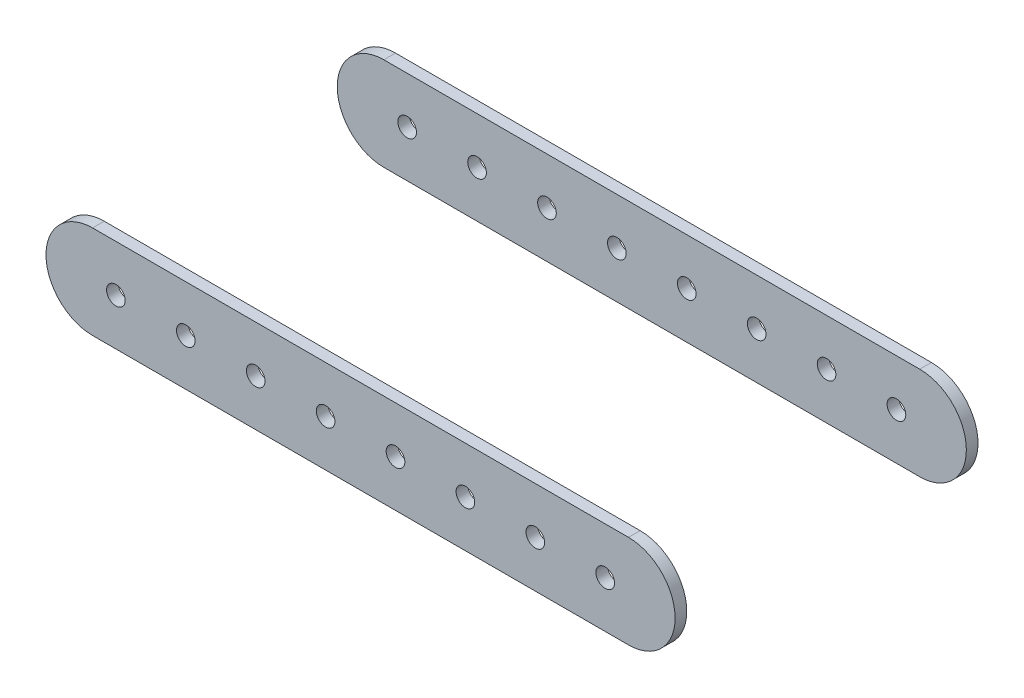
ISO-10303-21;
HEADER;
FILE_DESCRIPTION(('STEP AP214'),'2;1');
FILE_NAME('part.step','',(''),(''),'','','');
FILE_SCHEMA(('AUTOMOTIVE_DESIGN { 1 0 10303 214 1 1 1 1 }'));
ENDSEC;
DATA;
#1=APPLICATION_CONTEXT('core data for automotive mechanical design processes');
#2=APPLICATION_PROTOCOL_DEFINITION('international standard','automotive_design',2000,#1);
#3=PRODUCT_CONTEXT('',#1,'mechanical');
#4=PRODUCT('Part','Part','',(#3));
#5=PRODUCT_RELATED_PRODUCT_CATEGORY('part','',(#4));
#6=PRODUCT_DEFINITION_FORMATION('','',#4);
#7=PRODUCT_DEFINITION_CONTEXT('part definition',#1,'design');
#8=PRODUCT_DEFINITION('design','',#6,#7);
#9=PRODUCT_DEFINITION_SHAPE('','',#8);
#10=(LENGTH_UNIT() NAMED_UNIT(*) SI_UNIT(.MILLI.,.METRE.));
#11=(NAMED_UNIT(*) PLANE_ANGLE_UNIT() SI_UNIT($,.RADIAN.));
#12=(NAMED_UNIT(*) SI_UNIT($,.STERADIAN.) SOLID_ANGLE_UNIT());
#13=UNCERTAINTY_MEASURE_WITH_UNIT(LENGTH_MEASURE(1.E-05),#10,'distance_accuracy_value','');
#14=(GEOMETRIC_REPRESENTATION_CONTEXT(3) GLOBAL_UNCERTAINTY_ASSIGNED_CONTEXT((#13)) GLOBAL_UNIT_ASSIGNED_CONTEXT((#10,
#11,#12)) REPRESENTATION_CONTEXT('',''));
#15=CARTESIAN_POINT('',(0.,0.,0.));
#16=DIRECTION('',(0.,0.,1.));
#17=DIRECTION('',(1.,0.,0.));
#18=AXIS2_PLACEMENT_3D('',#15,#16,#17);
#19=CARTESIAN_POINT('',(-10.,0.,-65.));
#20=DIRECTION('',(0.,0.,-1.));
#21=DIRECTION('',(1.,0.,0.));
#22=AXIS2_PLACEMENT_3D('',#19,#20,#21);
#23=PLANE('',#22);
#24=CARTESIAN_POINT('',(150.,0.,-65.));
#25=DIRECTION('',(0.,0.,1.));
#26=DIRECTION('',(1.,0.,0.));
#27=AXIS2_PLACEMENT_3D('',#24,#25,#26);
#28=CIRCLE('',#27,3.99999999999999);
#29=CARTESIAN_POINT('',(154.,0.,-65.));
#30=VERTEX_POINT('',#29);
#31=EDGE_CURVE('E210',#30,#30,#28,.T.);
#32=ORIENTED_EDGE('',*,*,#31,.T.);
#33=EDGE_LOOP('',(#32));
#34=FACE_BOUND('',#33,.T.);
#35=CARTESIAN_POINT('',(90.,0.,-65.));
#36=DIRECTION('',(0.,0.,1.));
#37=DIRECTION('',(1.,0.,0.));
#38=AXIS2_PLACEMENT_3D('',#35,#36,#37);
#39=CIRCLE('',#38,4.00000000000001);
#40=CARTESIAN_POINT('',(94.,0.,-65.));
#41=VERTEX_POINT('',#40);
#42=EDGE_CURVE('E217',#41,#41,#39,.T.);
#43=ORIENTED_EDGE('',*,*,#42,.T.);
#44=EDGE_LOOP('',(#43));
#45=FACE_BOUND('',#44,.T.);
#46=CARTESIAN_POINT('',(30.,0.,-65.));
#47=DIRECTION('',(0.,0.,1.));
#48=DIRECTION('',(1.,0.,0.));
#49=AXIS2_PLACEMENT_3D('',#46,#47,#48);
#50=CIRCLE('',#49,4.);
#51=CARTESIAN_POINT('',(34.,0.,-65.));
#52=VERTEX_POINT('',#51);
#53=EDGE_CURVE('E222',#52,#52,#50,.T.);
#54=ORIENTED_EDGE('',*,*,#53,.T.);
#55=EDGE_LOOP('',(#54));
#56=FACE_BOUND('',#55,.T.);
#57=CARTESIAN_POINT('',(0.,0.,-65.));
#58=DIRECTION('',(0.,0.,1.));
#59=DIRECTION('',(1.,0.,0.));
#60=AXIS2_PLACEMENT_3D('',#57,#58,#59);
#61=CIRCLE('',#60,4.);
#62=CARTESIAN_POINT('',(4.,0.,-65.));
#63=VERTEX_POINT('',#62);
#64=EDGE_CURVE('E114',#63,#63,#61,.T.);
#65=ORIENTED_EDGE('',*,*,#64,.T.);
#66=EDGE_LOOP('',(#65));
#67=FACE_BOUND('',#66,.T.);
#68=CARTESIAN_POINT('',(-10.,0.,-65.));
#69=DIRECTION('',(0.,0.,1.));
#70=DIRECTION('',(1.,0.,0.));
#71=AXIS2_PLACEMENT_3D('',#68,#69,#70);
#72=CIRCLE('',#71,20.);
#73=CARTESIAN_POINT('',(-10.,20.,-65.));
#74=VERTEX_POINT('',#73);
#75=CARTESIAN_POINT('',(-10.,-20.,-65.));
#76=VERTEX_POINT('',#75);
#77=EDGE_CURVE('E102',#74,#76,#72,.T.);
#78=ORIENTED_EDGE('',*,*,#77,.F.);
#79=DIRECTION('',(-1.,0.,0.));
#80=VECTOR('',#79,1.);
#81=CARTESIAN_POINT('',(-10.,20.,-65.));
#82=LINE('',#81,#80);
#83=CARTESIAN_POINT('',(220.,20.,-65.));
#84=VERTEX_POINT('',#83);
#85=EDGE_CURVE('E105',#84,#74,#82,.T.);
#86=ORIENTED_EDGE('',*,*,#85,.F.);
#87=CARTESIAN_POINT('',(220.,0.,-65.));
#88=DIRECTION('',(0.,0.,1.));
#89=DIRECTION('',(1.,0.,0.));
#90=AXIS2_PLACEMENT_3D('',#87,#88,#89);
#91=CIRCLE('',#90,20.);
#92=CARTESIAN_POINT('',(220.,-20.,-65.));
#93=VERTEX_POINT('',#92);
#94=EDGE_CURVE('E92',#93,#84,#91,.T.);
#95=ORIENTED_EDGE('',*,*,#94,.F.);
#96=DIRECTION('',(1.,0.,0.));
#97=VECTOR('',#96,1.);
#98=CARTESIAN_POINT('',(-10.,-20.,-65.));
#99=LINE('',#98,#97);
#100=EDGE_CURVE('E98',#76,#93,#99,.T.);
#101=ORIENTED_EDGE('',*,*,#100,.F.);
#102=EDGE_LOOP('',(#78,#86,#95,#101));
#103=FACE_BOUND('',#102,.T.);
#104=CARTESIAN_POINT('',(210.,0.,-65.));
#105=DIRECTION('',(0.,0.,1.));
#106=DIRECTION('',(1.,0.,0.));
#107=AXIS2_PLACEMENT_3D('',#104,#105,#106);
#108=CIRCLE('',#107,3.99999999999999);
#109=CARTESIAN_POINT('',(214.,0.,-65.));
#110=VERTEX_POINT('',#109);
#111=EDGE_CURVE('E142',#110,#110,#108,.T.);
#112=ORIENTED_EDGE('',*,*,#111,.T.);
#113=EDGE_LOOP('',(#112));
#114=FACE_BOUND('',#113,.T.);
#115=CARTESIAN_POINT('',(60.,0.,-65.));
#116=DIRECTION('',(0.,0.,1.));
#117=DIRECTION('',(1.,0.,0.));
#118=AXIS2_PLACEMENT_3D('',#115,#116,#117);
#119=CIRCLE('',#118,4.00000000000001);
#120=CARTESIAN_POINT('',(64.,0.,-65.));
#121=VERTEX_POINT('',#120);
#122=EDGE_CURVE('E220',#121,#121,#119,.T.);
#123=ORIENTED_EDGE('',*,*,#122,.T.);
#124=EDGE_LOOP('',(#123));
#125=FACE_BOUND('',#124,.T.);
#126=CARTESIAN_POINT('',(120.,0.,-65.));
#127=DIRECTION('',(0.,0.,1.));
#128=DIRECTION('',(1.,0.,0.));
#129=AXIS2_PLACEMENT_3D('',#126,#127,#128);
#130=CIRCLE('',#129,4.00000000000001);
#131=CARTESIAN_POINT('',(124.,0.,-65.));
#132=VERTEX_POINT('',#131);
#133=EDGE_CURVE('E212',#132,#132,#130,.T.);
#134=ORIENTED_EDGE('',*,*,#133,.T.);
#135=EDGE_LOOP('',(#134));
#136=FACE_BOUND('',#135,.T.);
#137=CARTESIAN_POINT('',(180.,0.,-65.));
#138=DIRECTION('',(0.,0.,1.));
#139=DIRECTION('',(1.,0.,0.));
#140=AXIS2_PLACEMENT_3D('',#137,#138,#139);
#141=CIRCLE('',#140,3.99999999999999);
#142=CARTESIAN_POINT('',(184.,0.,-65.));
#143=VERTEX_POINT('',#142);
#144=EDGE_CURVE('E125',#143,#143,#141,.T.);
#145=ORIENTED_EDGE('',*,*,#144,.T.);
#146=EDGE_LOOP('',(#145));
#147=FACE_BOUND('',#146,.T.);
#148=ADVANCED_FACE('F43',(#34,#45,#56,#67,#103,#114,#125,#136,#147),#23,.T.);
#149=CARTESIAN_POINT('',(-10.,0.,-60.));
#150=DIRECTION('',(0.,0.,-1.));
#151=DIRECTION('',(1.,0.,0.));
#152=AXIS2_PLACEMENT_3D('',#149,#150,#151);
#153=PLANE('',#152);
#154=CARTESIAN_POINT('',(-10.,0.,-60.));
#155=DIRECTION('',(0.,0.,1.));
#156=DIRECTION('',(1.,0.,0.));
#157=AXIS2_PLACEMENT_3D('',#154,#155,#156);
#158=CIRCLE('',#157,20.);
#159=CARTESIAN_POINT('',(-10.,20.,-60.));
#160=VERTEX_POINT('',#159);
#161=CARTESIAN_POINT('',(-10.,-20.,-60.));
#162=VERTEX_POINT('',#161);
#163=EDGE_CURVE('E110',#160,#162,#158,.T.);
#164=ORIENTED_EDGE('',*,*,#163,.T.);
#165=DIRECTION('',(1.,0.,0.));
#166=VECTOR('',#165,1.);
#167=CARTESIAN_POINT('',(-10.,-20.,-60.));
#168=LINE('',#167,#166);
#169=CARTESIAN_POINT('',(220.,-20.,-60.));
#170=VERTEX_POINT('',#169);
#171=EDGE_CURVE('E113',#162,#170,#168,.T.);
#172=ORIENTED_EDGE('',*,*,#171,.T.);
#173=CARTESIAN_POINT('',(220.,0.,-60.));
#174=DIRECTION('',(0.,0.,1.));
#175=DIRECTION('',(1.,0.,0.));
#176=AXIS2_PLACEMENT_3D('',#173,#174,#175);
#177=CIRCLE('',#176,20.);
#178=CARTESIAN_POINT('',(220.,20.,-60.));
#179=VERTEX_POINT('',#178);
#180=EDGE_CURVE('E95',#170,#179,#177,.T.);
#181=ORIENTED_EDGE('',*,*,#180,.T.);
#182=DIRECTION('',(-1.,0.,0.));
#183=VECTOR('',#182,1.);
#184=CARTESIAN_POINT('',(-10.,20.,-60.));
#185=LINE('',#184,#183);
#186=EDGE_CURVE('E117',#179,#160,#185,.T.);
#187=ORIENTED_EDGE('',*,*,#186,.T.);
#188=EDGE_LOOP('',(#164,#172,#181,#187));
#189=FACE_BOUND('',#188,.T.);
#190=CARTESIAN_POINT('',(0.,0.,-60.));
#191=DIRECTION('',(0.,0.,1.));
#192=DIRECTION('',(1.,0.,0.));
#193=AXIS2_PLACEMENT_3D('',#190,#191,#192);
#194=CIRCLE('',#193,4.);
#195=CARTESIAN_POINT('',(4.,0.,-60.));
#196=VERTEX_POINT('',#195);
#197=EDGE_CURVE('E147',#196,#196,#194,.T.);
#198=ORIENTED_EDGE('',*,*,#197,.F.);
#199=EDGE_LOOP('',(#198));
#200=FACE_BOUND('',#199,.T.);
#201=CARTESIAN_POINT('',(210.,0.,-60.));
#202=DIRECTION('',(0.,0.,1.));
#203=DIRECTION('',(1.,0.,0.));
#204=AXIS2_PLACEMENT_3D('',#201,#202,#203);
#205=CIRCLE('',#204,3.99999999999999);
#206=CARTESIAN_POINT('',(214.,0.,-60.));
#207=VERTEX_POINT('',#206);
#208=EDGE_CURVE('E138',#207,#207,#205,.T.);
#209=ORIENTED_EDGE('',*,*,#208,.F.);
#210=EDGE_LOOP('',(#209));
#211=FACE_BOUND('',#210,.T.);
#212=CARTESIAN_POINT('',(30.,0.,-60.));
#213=DIRECTION('',(0.,0.,-1.));
#214=DIRECTION('',(-1.,0.,0.));
#215=AXIS2_PLACEMENT_3D('',#212,#213,#214);
#216=CIRCLE('',#215,4.);
#217=CARTESIAN_POINT('',(26.,0.,-60.));
#218=VERTEX_POINT('',#217);
#219=EDGE_CURVE('E121',#218,#218,#216,.F.);
#220=ORIENTED_EDGE('',*,*,#219,.F.);
#221=EDGE_LOOP('',(#220));
#222=FACE_BOUND('',#221,.T.);
#223=CARTESIAN_POINT('',(60.,0.,-60.));
#224=DIRECTION('',(0.,0.,-1.));
#225=DIRECTION('',(-1.,0.,0.));
#226=AXIS2_PLACEMENT_3D('',#223,#224,#225);
#227=CIRCLE('',#226,4.00000000000001);
#228=CARTESIAN_POINT('',(56.,0.,-60.));
#229=VERTEX_POINT('',#228);
#230=EDGE_CURVE('E124',#229,#229,#227,.F.);
#231=ORIENTED_EDGE('',*,*,#230,.F.);
#232=EDGE_LOOP('',(#231));
#233=FACE_BOUND('',#232,.T.);
#234=CARTESIAN_POINT('',(90.,0.,-60.));
#235=DIRECTION('',(0.,0.,-1.));
#236=DIRECTION('',(-1.,0.,0.));
#237=AXIS2_PLACEMENT_3D('',#234,#235,#236);
#238=CIRCLE('',#237,4.00000000000001);
#239=CARTESIAN_POINT('',(86.,0.,-60.));
#240=VERTEX_POINT('',#239);
#241=EDGE_CURVE('E128',#240,#240,#238,.F.);
#242=ORIENTED_EDGE('',*,*,#241,.F.);
#243=EDGE_LOOP('',(#242));
#244=FACE_BOUND('',#243,.T.);
#245=CARTESIAN_POINT('',(120.,0.,-60.));
#246=DIRECTION('',(0.,0.,-1.));
#247=DIRECTION('',(-1.,0.,0.));
#248=AXIS2_PLACEMENT_3D('',#245,#246,#247);
#249=CIRCLE('',#248,4.00000000000001);
#250=CARTESIAN_POINT('',(116.,0.,-60.));
#251=VERTEX_POINT('',#250);
#252=EDGE_CURVE('E131',#251,#251,#249,.F.);
#253=ORIENTED_EDGE('',*,*,#252,.F.);
#254=EDGE_LOOP('',(#253));
#255=FACE_BOUND('',#254,.T.);
#256=CARTESIAN_POINT('',(150.,0.,-60.));
#257=DIRECTION('',(0.,0.,-1.));
#258=DIRECTION('',(-1.,0.,0.));
#259=AXIS2_PLACEMENT_3D('',#256,#257,#258);
#260=CIRCLE('',#259,3.99999999999999);
#261=CARTESIAN_POINT('',(146.,0.,-60.));
#262=VERTEX_POINT('',#261);
#263=EDGE_CURVE('E133',#262,#262,#260,.F.);
#264=ORIENTED_EDGE('',*,*,#263,.F.);
#265=EDGE_LOOP('',(#264));
#266=FACE_BOUND('',#265,.T.);
#267=CARTESIAN_POINT('',(180.,0.,-60.));
#268=DIRECTION('',(0.,0.,-1.));
#269=DIRECTION('',(-1.,0.,0.));
#270=AXIS2_PLACEMENT_3D('',#267,#268,#269);
#271=CIRCLE('',#270,3.99999999999999);
#272=CARTESIAN_POINT('',(176.,0.,-60.));
#273=VERTEX_POINT('',#272);
#274=EDGE_CURVE('E47',#273,#273,#271,.F.);
#275=ORIENTED_EDGE('',*,*,#274,.F.);
#276=EDGE_LOOP('',(#275));
#277=FACE_BOUND('',#276,.T.);
#278=ADVANCED_FACE('F155',(#189,#200,#211,#222,#233,#244,#255,#266,#277),#153,.F.);
#279=CARTESIAN_POINT('',(-10.,0.,-65.));
#280=DIRECTION('',(0.,0.,1.));
#281=DIRECTION('',(-1.,0.,0.));
#282=AXIS2_PLACEMENT_3D('',#279,#280,#281);
#283=CYLINDRICAL_SURFACE('',#282,20.);
#284=ORIENTED_EDGE('',*,*,#163,.F.);
#285=DIRECTION('',(0.,0.,1.));
#286=VECTOR('',#285,1.);
#287=CARTESIAN_POINT('',(-10.,20.,-65.));
#288=LINE('',#287,#286);
#289=EDGE_CURVE('E62',#74,#160,#288,.T.);
#290=ORIENTED_EDGE('',*,*,#289,.F.);
#291=ORIENTED_EDGE('',*,*,#77,.T.);
#292=DIRECTION('',(0.,0.,1.));
#293=VECTOR('',#292,1.);
#294=CARTESIAN_POINT('',(-10.,-20.,-65.));
#295=LINE('',#294,#293);
#296=EDGE_CURVE('E12',#76,#162,#295,.T.);
#297=ORIENTED_EDGE('',*,*,#296,.T.);
#298=EDGE_LOOP('',(#284,#290,#291,#297));
#299=FACE_BOUND('',#298,.T.);
#300=ADVANCED_FACE('F45',(#299),#283,.T.);
#301=CARTESIAN_POINT('',(-10.,-20.,-65.));
#302=DIRECTION('',(0.,1.,0.));
#303=DIRECTION('',(0.,0.,-1.));
#304=AXIS2_PLACEMENT_3D('',#301,#302,#303);
#305=PLANE('',#304);
#306=ORIENTED_EDGE('',*,*,#171,.F.);
#307=ORIENTED_EDGE('',*,*,#296,.F.);
#308=ORIENTED_EDGE('',*,*,#100,.T.);
#309=DIRECTION('',(0.,0.,1.));
#310=VECTOR('',#309,1.);
#311=CARTESIAN_POINT('',(220.,-20.,-65.));
#312=LINE('',#311,#310);
#313=EDGE_CURVE('E53',#93,#170,#312,.T.);
#314=ORIENTED_EDGE('',*,*,#313,.T.);
#315=EDGE_LOOP('',(#306,#307,#308,#314));
#316=FACE_BOUND('',#315,.T.);
#317=ADVANCED_FACE('F99',(#316),#305,.F.);
#318=CARTESIAN_POINT('',(220.,0.,-65.));
#319=DIRECTION('',(0.,0.,1.));
#320=DIRECTION('',(-1.,0.,0.));
#321=AXIS2_PLACEMENT_3D('',#318,#319,#320);
#322=CYLINDRICAL_SURFACE('',#321,20.);
#323=ORIENTED_EDGE('',*,*,#180,.F.);
#324=ORIENTED_EDGE('',*,*,#313,.F.);
#325=ORIENTED_EDGE('',*,*,#94,.T.);
#326=DIRECTION('',(0.,0.,1.));
#327=VECTOR('',#326,1.);
#328=CARTESIAN_POINT('',(220.,20.,-65.));
#329=LINE('',#328,#327);
#330=EDGE_CURVE('E78',#84,#179,#329,.T.);
#331=ORIENTED_EDGE('',*,*,#330,.T.);
#332=EDGE_LOOP('',(#323,#324,#325,#331));
#333=FACE_BOUND('',#332,.T.);
#334=ADVANCED_FACE('F90',(#333),#322,.T.);
#335=CARTESIAN_POINT('',(-10.,20.,-65.));
#336=DIRECTION('',(0.,-1.,0.));
#337=DIRECTION('',(0.,0.,1.));
#338=AXIS2_PLACEMENT_3D('',#335,#336,#337);
#339=PLANE('',#338);
#340=ORIENTED_EDGE('',*,*,#186,.F.);
#341=ORIENTED_EDGE('',*,*,#330,.F.);
#342=ORIENTED_EDGE('',*,*,#85,.T.);
#343=ORIENTED_EDGE('',*,*,#289,.T.);
#344=EDGE_LOOP('',(#340,#341,#342,#343));
#345=FACE_BOUND('',#344,.T.);
#346=ADVANCED_FACE('F157',(#345),#339,.F.);
#347=CARTESIAN_POINT('',(0.,0.,-65.));
#348=DIRECTION('',(0.,0.,1.));
#349=DIRECTION('',(-1.,0.,0.));
#350=AXIS2_PLACEMENT_3D('',#347,#348,#349);
#351=CYLINDRICAL_SURFACE('',#350,4.);
#352=ORIENTED_EDGE('',*,*,#64,.F.);
#353=EDGE_LOOP('',(#352));
#354=FACE_BOUND('',#353,.T.);
#355=ORIENTED_EDGE('',*,*,#197,.T.);
#356=EDGE_LOOP('',(#355));
#357=FACE_BOUND('',#356,.T.);
#358=ADVANCED_FACE('F159',(#354,#357),#351,.F.);
#359=CARTESIAN_POINT('',(210.,0.,-65.));
#360=DIRECTION('',(0.,0.,1.));
#361=DIRECTION('',(-1.,0.,0.));
#362=AXIS2_PLACEMENT_3D('',#359,#360,#361);
#363=CYLINDRICAL_SURFACE('',#362,3.99999999999999);
#364=ORIENTED_EDGE('',*,*,#111,.F.);
#365=EDGE_LOOP('',(#364));
#366=FACE_BOUND('',#365,.T.);
#367=ORIENTED_EDGE('',*,*,#208,.T.);
#368=EDGE_LOOP('',(#367));
#369=FACE_BOUND('',#368,.T.);
#370=ADVANCED_FACE('F165',(#366,#369),#363,.F.);
#371=CARTESIAN_POINT('',(30.,0.,65.));
#372=DIRECTION('',(0.,0.,-1.));
#373=DIRECTION('',(-1.,0.,0.));
#374=AXIS2_PLACEMENT_3D('',#371,#372,#373);
#375=CYLINDRICAL_SURFACE('',#374,4.);
#376=ORIENTED_EDGE('',*,*,#53,.F.);
#377=EDGE_LOOP('',(#376));
#378=FACE_BOUND('',#377,.T.);
#379=ORIENTED_EDGE('',*,*,#219,.T.);
#380=EDGE_LOOP('',(#379));
#381=FACE_BOUND('',#380,.T.);
#382=ADVANCED_FACE('F181',(#378,#381),#375,.F.);
#383=CARTESIAN_POINT('',(60.,0.,65.));
#384=DIRECTION('',(0.,0.,-1.));
#385=DIRECTION('',(-1.,0.,0.));
#386=AXIS2_PLACEMENT_3D('',#383,#384,#385);
#387=CYLINDRICAL_SURFACE('',#386,4.00000000000001);
#388=ORIENTED_EDGE('',*,*,#122,.F.);
#389=EDGE_LOOP('',(#388));
#390=FACE_BOUND('',#389,.T.);
#391=ORIENTED_EDGE('',*,*,#230,.T.);
#392=EDGE_LOOP('',(#391));
#393=FACE_BOUND('',#392,.T.);
#394=ADVANCED_FACE('F185',(#390,#393),#387,.F.);
#395=CARTESIAN_POINT('',(90.,0.,65.));
#396=DIRECTION('',(0.,0.,-1.));
#397=DIRECTION('',(-1.,0.,0.));
#398=AXIS2_PLACEMENT_3D('',#395,#396,#397);
#399=CYLINDRICAL_SURFACE('',#398,4.00000000000001);
#400=ORIENTED_EDGE('',*,*,#42,.F.);
#401=EDGE_LOOP('',(#400));
#402=FACE_BOUND('',#401,.T.);
#403=ORIENTED_EDGE('',*,*,#241,.T.);
#404=EDGE_LOOP('',(#403));
#405=FACE_BOUND('',#404,.T.);
#406=ADVANCED_FACE('F189',(#402,#405),#399,.F.);
#407=CARTESIAN_POINT('',(120.,0.,65.));
#408=DIRECTION('',(0.,0.,-1.));
#409=DIRECTION('',(-1.,0.,0.));
#410=AXIS2_PLACEMENT_3D('',#407,#408,#409);
#411=CYLINDRICAL_SURFACE('',#410,4.00000000000001);
#412=ORIENTED_EDGE('',*,*,#133,.F.);
#413=EDGE_LOOP('',(#412));
#414=FACE_BOUND('',#413,.T.);
#415=ORIENTED_EDGE('',*,*,#252,.T.);
#416=EDGE_LOOP('',(#415));
#417=FACE_BOUND('',#416,.T.);
#418=ADVANCED_FACE('F193',(#414,#417),#411,.F.);
#419=CARTESIAN_POINT('',(150.,0.,65.));
#420=DIRECTION('',(0.,0.,-1.));
#421=DIRECTION('',(-1.,0.,0.));
#422=AXIS2_PLACEMENT_3D('',#419,#420,#421);
#423=CYLINDRICAL_SURFACE('',#422,3.99999999999999);
#424=ORIENTED_EDGE('',*,*,#31,.F.);
#425=EDGE_LOOP('',(#424));
#426=FACE_BOUND('',#425,.T.);
#427=ORIENTED_EDGE('',*,*,#263,.T.);
#428=EDGE_LOOP('',(#427));
#429=FACE_BOUND('',#428,.T.);
#430=ADVANCED_FACE('F197',(#426,#429),#423,.F.);
#431=CARTESIAN_POINT('',(180.,0.,65.));
#432=DIRECTION('',(0.,0.,-1.));
#433=DIRECTION('',(-1.,0.,0.));
#434=AXIS2_PLACEMENT_3D('',#431,#432,#433);
#435=CYLINDRICAL_SURFACE('',#434,3.99999999999999);
#436=ORIENTED_EDGE('',*,*,#144,.F.);
#437=EDGE_LOOP('',(#436));
#438=FACE_BOUND('',#437,.T.);
#439=ORIENTED_EDGE('',*,*,#274,.T.);
#440=EDGE_LOOP('',(#439));
#441=FACE_BOUND('',#440,.T.);
#442=ADVANCED_FACE('F201',(#438,#441),#435,.F.);
#443=CLOSED_SHELL('',(#148,#278,#300,#317,#334,#346,#358,#370,#382,#394,#406,#418,#430,#442));
#444=MANIFOLD_SOLID_BREP('B2',#443);
#445=CARTESIAN_POINT('',(-10.,0.,65.));
#446=DIRECTION('',(0.,0.,1.));
#447=DIRECTION('',(1.,0.,0.));
#448=AXIS2_PLACEMENT_3D('',#445,#446,#447);
#449=PLANE('',#448);
#450=CARTESIAN_POINT('',(150.,0.,65.));
#451=DIRECTION('',(0.,0.,1.));
#452=DIRECTION('',(1.,0.,0.));
#453=AXIS2_PLACEMENT_3D('',#450,#451,#452);
#454=CIRCLE('',#453,3.99999999999999);
#455=CARTESIAN_POINT('',(154.,0.,65.));
#456=VERTEX_POINT('',#455);
#457=EDGE_CURVE('E556',#456,#456,#454,.T.);
#458=ORIENTED_EDGE('',*,*,#457,.F.);
#459=EDGE_LOOP('',(#458));
#460=FACE_BOUND('',#459,.T.);
#461=CARTESIAN_POINT('',(90.,0.,65.));
#462=DIRECTION('',(0.,0.,1.));
#463=DIRECTION('',(1.,0.,0.));
#464=AXIS2_PLACEMENT_3D('',#461,#462,#463);
#465=CIRCLE('',#464,4.00000000000001);
#466=CARTESIAN_POINT('',(94.,0.,65.));
#467=VERTEX_POINT('',#466);
#468=EDGE_CURVE('E564',#467,#467,#465,.T.);
#469=ORIENTED_EDGE('',*,*,#468,.F.);
#470=EDGE_LOOP('',(#469));
#471=FACE_BOUND('',#470,.T.);
#472=CARTESIAN_POINT('',(30.,0.,65.));
#473=DIRECTION('',(0.,0.,1.));
#474=DIRECTION('',(1.,0.,0.));
#475=AXIS2_PLACEMENT_3D('',#472,#473,#474);
#476=CIRCLE('',#475,4.);
#477=CARTESIAN_POINT('',(34.,0.,65.));
#478=VERTEX_POINT('',#477);
#479=EDGE_CURVE('E569',#478,#478,#476,.T.);
#480=ORIENTED_EDGE('',*,*,#479,.F.);
#481=EDGE_LOOP('',(#480));
#482=FACE_BOUND('',#481,.T.);
#483=CARTESIAN_POINT('',(0.,0.,65.));
#484=DIRECTION('',(0.,0.,1.));
#485=DIRECTION('',(1.,0.,0.));
#486=AXIS2_PLACEMENT_3D('',#483,#484,#485);
#487=CIRCLE('',#486,4.);
#488=CARTESIAN_POINT('',(4.,0.,65.));
#489=VERTEX_POINT('',#488);
#490=EDGE_CURVE('E405',#489,#489,#487,.T.);
#491=ORIENTED_EDGE('',*,*,#490,.F.);
#492=EDGE_LOOP('',(#491));
#493=FACE_BOUND('',#492,.T.);
#494=CARTESIAN_POINT('',(-10.,0.,65.));
#495=DIRECTION('',(0.,0.,1.));
#496=DIRECTION('',(1.,0.,0.));
#497=AXIS2_PLACEMENT_3D('',#494,#495,#496);
#498=CIRCLE('',#497,20.);
#499=CARTESIAN_POINT('',(-10.,20.,65.));
#500=VERTEX_POINT('',#499);
#501=CARTESIAN_POINT('',(-10.,-20.,65.));
#502=VERTEX_POINT('',#501);
#503=EDGE_CURVE('E389',#500,#502,#498,.T.);
#504=ORIENTED_EDGE('',*,*,#503,.T.);
#505=DIRECTION('',(1.,0.,0.));
#506=VECTOR('',#505,1.);
#507=CARTESIAN_POINT('',(-10.,-20.,65.));
#508=LINE('',#507,#506);
#509=CARTESIAN_POINT('',(220.,-20.,65.));
#510=VERTEX_POINT('',#509);
#511=EDGE_CURVE('E384',#502,#510,#508,.T.);
#512=ORIENTED_EDGE('',*,*,#511,.T.);
#513=CARTESIAN_POINT('',(220.,0.,65.));
#514=DIRECTION('',(0.,0.,1.));
#515=DIRECTION('',(1.,0.,0.));
#516=AXIS2_PLACEMENT_3D('',#513,#514,#515);
#517=CIRCLE('',#516,20.);
#518=CARTESIAN_POINT('',(220.,20.,65.));
#519=VERTEX_POINT('',#518);
#520=EDGE_CURVE('E387',#510,#519,#517,.T.);
#521=ORIENTED_EDGE('',*,*,#520,.T.);
#522=DIRECTION('',(-1.,0.,0.));
#523=VECTOR('',#522,1.);
#524=CARTESIAN_POINT('',(-10.,20.,65.));
#525=LINE('',#524,#523);
#526=EDGE_CURVE('E354',#519,#500,#525,.T.);
#527=ORIENTED_EDGE('',*,*,#526,.T.);
#528=EDGE_LOOP('',(#504,#512,#521,#527));
#529=FACE_BOUND('',#528,.T.);
#530=CARTESIAN_POINT('',(210.,0.,65.));
#531=DIRECTION('',(0.,0.,1.));
#532=DIRECTION('',(1.,0.,0.));
#533=AXIS2_PLACEMENT_3D('',#530,#531,#532);
#534=CIRCLE('',#533,3.99999999999999);
#535=CARTESIAN_POINT('',(214.,0.,65.));
#536=VERTEX_POINT('',#535);
#537=EDGE_CURVE('E432',#536,#536,#534,.T.);
#538=ORIENTED_EDGE('',*,*,#537,.F.);
#539=EDGE_LOOP('',(#538));
#540=FACE_BOUND('',#539,.T.);
#541=CARTESIAN_POINT('',(60.,0.,65.));
#542=DIRECTION('',(0.,0.,1.));
#543=DIRECTION('',(1.,0.,0.));
#544=AXIS2_PLACEMENT_3D('',#541,#542,#543);
#545=CIRCLE('',#544,4.00000000000001);
#546=CARTESIAN_POINT('',(64.,0.,65.));
#547=VERTEX_POINT('',#546);
#548=EDGE_CURVE('E567',#547,#547,#545,.T.);
#549=ORIENTED_EDGE('',*,*,#548,.F.);
#550=EDGE_LOOP('',(#549));
#551=FACE_BOUND('',#550,.T.);
#552=CARTESIAN_POINT('',(120.,0.,65.));
#553=DIRECTION('',(0.,0.,1.));
#554=DIRECTION('',(1.,0.,0.));
#555=AXIS2_PLACEMENT_3D('',#552,#553,#554);
#556=CIRCLE('',#555,4.00000000000001);
#557=CARTESIAN_POINT('',(124.,0.,65.));
#558=VERTEX_POINT('',#557);
#559=EDGE_CURVE('E559',#558,#558,#556,.T.);
#560=ORIENTED_EDGE('',*,*,#559,.F.);
#561=EDGE_LOOP('',(#560));
#562=FACE_BOUND('',#561,.T.);
#563=CARTESIAN_POINT('',(180.,0.,65.));
#564=DIRECTION('',(0.,0.,1.));
#565=DIRECTION('',(1.,0.,0.));
#566=AXIS2_PLACEMENT_3D('',#563,#564,#565);
#567=CIRCLE('',#566,3.99999999999999);
#568=CARTESIAN_POINT('',(184.,0.,65.));
#569=VERTEX_POINT('',#568);
#570=EDGE_CURVE('E415',#569,#569,#567,.T.);
#571=ORIENTED_EDGE('',*,*,#570,.F.);
#572=EDGE_LOOP('',(#571));
#573=FACE_BOUND('',#572,.T.);
#574=ADVANCED_FACE('F335',(#460,#471,#482,#493,#529,#540,#551,#562,#573),#449,.T.);
#575=CARTESIAN_POINT('',(-10.,0.,60.));
#576=DIRECTION('',(0.,0.,1.));
#577=DIRECTION('',(1.,0.,0.));
#578=AXIS2_PLACEMENT_3D('',#575,#576,#577);
#579=PLANE('',#578);
#580=CARTESIAN_POINT('',(-10.,0.,60.));
#581=DIRECTION('',(0.,0.,1.));
#582=DIRECTION('',(1.,0.,0.));
#583=AXIS2_PLACEMENT_3D('',#580,#581,#582);
#584=CIRCLE('',#583,20.);
#585=CARTESIAN_POINT('',(-10.,20.,60.));
#586=VERTEX_POINT('',#585);
#587=CARTESIAN_POINT('',(-10.,-20.,60.));
#588=VERTEX_POINT('',#587);
#589=EDGE_CURVE('E402',#586,#588,#584,.T.);
#590=ORIENTED_EDGE('',*,*,#589,.F.);
#591=DIRECTION('',(-1.,0.,0.));
#592=VECTOR('',#591,1.);
#593=CARTESIAN_POINT('',(-10.,20.,60.));
#594=LINE('',#593,#592);
#595=CARTESIAN_POINT('',(220.,20.,60.));
#596=VERTEX_POINT('',#595);
#597=EDGE_CURVE('E377',#596,#586,#594,.T.);
#598=ORIENTED_EDGE('',*,*,#597,.F.);
#599=CARTESIAN_POINT('',(220.,0.,60.));
#600=DIRECTION('',(0.,0.,1.));
#601=DIRECTION('',(1.,0.,0.));
#602=AXIS2_PLACEMENT_3D('',#599,#600,#601);
#603=CIRCLE('',#602,20.);
#604=CARTESIAN_POINT('',(220.,-20.,60.));
#605=VERTEX_POINT('',#604);
#606=EDGE_CURVE('E371',#605,#596,#603,.T.);
#607=ORIENTED_EDGE('',*,*,#606,.F.);
#608=DIRECTION('',(1.,0.,0.));
#609=VECTOR('',#608,1.);
#610=CARTESIAN_POINT('',(-10.,-20.,60.));
#611=LINE('',#610,#609);
#612=EDGE_CURVE('E393',#588,#605,#611,.T.);
#613=ORIENTED_EDGE('',*,*,#612,.F.);
#614=EDGE_LOOP('',(#590,#598,#607,#613));
#615=FACE_BOUND('',#614,.T.);
#616=CARTESIAN_POINT('',(0.,0.,60.));
#617=DIRECTION('',(0.,0.,1.));
#618=DIRECTION('',(1.,0.,0.));
#619=AXIS2_PLACEMENT_3D('',#616,#617,#618);
#620=CIRCLE('',#619,4.);
#621=CARTESIAN_POINT('',(4.,0.,60.));
#622=VERTEX_POINT('',#621);
#623=EDGE_CURVE('E437',#622,#622,#620,.T.);
#624=ORIENTED_EDGE('',*,*,#623,.T.);
#625=EDGE_LOOP('',(#624));
#626=FACE_BOUND('',#625,.T.);
#627=CARTESIAN_POINT('',(210.,0.,60.));
#628=DIRECTION('',(0.,0.,1.));
#629=DIRECTION('',(1.,0.,0.));
#630=AXIS2_PLACEMENT_3D('',#627,#628,#629);
#631=CIRCLE('',#630,3.99999999999999);
#632=CARTESIAN_POINT('',(214.,0.,60.));
#633=VERTEX_POINT('',#632);
#634=EDGE_CURVE('E428',#633,#633,#631,.T.);
#635=ORIENTED_EDGE('',*,*,#634,.T.);
#636=EDGE_LOOP('',(#635));
#637=FACE_BOUND('',#636,.T.);
#638=CARTESIAN_POINT('',(30.,0.,60.));
#639=DIRECTION('',(0.,0.,1.));
#640=DIRECTION('',(1.,0.,0.));
#641=AXIS2_PLACEMENT_3D('',#638,#639,#640);
#642=CIRCLE('',#641,4.);
#643=CARTESIAN_POINT('',(34.,0.,60.));
#644=VERTEX_POINT('',#643);
#645=EDGE_CURVE('E411',#644,#644,#642,.F.);
#646=ORIENTED_EDGE('',*,*,#645,.F.);
#647=EDGE_LOOP('',(#646));
#648=FACE_BOUND('',#647,.T.);
#649=CARTESIAN_POINT('',(60.,0.,60.));
#650=DIRECTION('',(0.,0.,1.));
#651=DIRECTION('',(1.,0.,0.));
#652=AXIS2_PLACEMENT_3D('',#649,#650,#651);
#653=CIRCLE('',#652,4.00000000000001);
#654=CARTESIAN_POINT('',(64.,0.,60.));
#655=VERTEX_POINT('',#654);
#656=EDGE_CURVE('E414',#655,#655,#653,.F.);
#657=ORIENTED_EDGE('',*,*,#656,.F.);
#658=EDGE_LOOP('',(#657));
#659=FACE_BOUND('',#658,.T.);
#660=CARTESIAN_POINT('',(90.,0.,60.));
#661=DIRECTION('',(0.,0.,1.));
#662=DIRECTION('',(1.,0.,0.));
#663=AXIS2_PLACEMENT_3D('',#660,#661,#662);
#664=CIRCLE('',#663,4.00000000000001);
#665=CARTESIAN_POINT('',(94.,0.,60.));
#666=VERTEX_POINT('',#665);
#667=EDGE_CURVE('E418',#666,#666,#664,.F.);
#668=ORIENTED_EDGE('',*,*,#667,.F.);
#669=EDGE_LOOP('',(#668));
#670=FACE_BOUND('',#669,.T.);
#671=CARTESIAN_POINT('',(120.,0.,60.));
#672=DIRECTION('',(0.,0.,1.));
#673=DIRECTION('',(1.,0.,0.));
#674=AXIS2_PLACEMENT_3D('',#671,#672,#673);
#675=CIRCLE('',#674,4.00000000000001);
#676=CARTESIAN_POINT('',(124.,0.,60.));
#677=VERTEX_POINT('',#676);
#678=EDGE_CURVE('E421',#677,#677,#675,.F.);
#679=ORIENTED_EDGE('',*,*,#678,.F.);
#680=EDGE_LOOP('',(#679));
#681=FACE_BOUND('',#680,.T.);
#682=CARTESIAN_POINT('',(150.,0.,60.));
#683=DIRECTION('',(0.,0.,1.));
#684=DIRECTION('',(1.,0.,0.));
#685=AXIS2_PLACEMENT_3D('',#682,#683,#684);
#686=CIRCLE('',#685,3.99999999999999);
#687=CARTESIAN_POINT('',(154.,0.,60.));
#688=VERTEX_POINT('',#687);
#689=EDGE_CURVE('E423',#688,#688,#686,.F.);
#690=ORIENTED_EDGE('',*,*,#689,.F.);
#691=EDGE_LOOP('',(#690));
#692=FACE_BOUND('',#691,.T.);
#693=CARTESIAN_POINT('',(180.,0.,60.));
#694=DIRECTION('',(0.,0.,1.));
#695=DIRECTION('',(1.,0.,0.));
#696=AXIS2_PLACEMENT_3D('',#693,#694,#695);
#697=CIRCLE('',#696,3.99999999999999);
#698=CARTESIAN_POINT('',(184.,0.,60.));
#699=VERTEX_POINT('',#698);
#700=EDGE_CURVE('E339',#699,#699,#697,.F.);
#701=ORIENTED_EDGE('',*,*,#700,.F.);
#702=EDGE_LOOP('',(#701));
#703=FACE_BOUND('',#702,.T.);
#704=ADVANCED_FACE('F446',(#615,#626,#637,#648,#659,#670,#681,#692,#703),#579,.F.);
#705=CARTESIAN_POINT('',(-10.,0.,65.));
#706=DIRECTION('',(0.,0.,-1.));
#707=DIRECTION('',(-1.,0.,0.));
#708=AXIS2_PLACEMENT_3D('',#705,#706,#707);
#709=CYLINDRICAL_SURFACE('',#708,20.);
#710=ORIENTED_EDGE('',*,*,#589,.T.);
#711=DIRECTION('',(0.,0.,-1.));
#712=VECTOR('',#711,1.);
#713=CARTESIAN_POINT('',(-10.,-20.,65.));
#714=LINE('',#713,#712);
#715=EDGE_CURVE('E41',#502,#588,#714,.T.);
#716=ORIENTED_EDGE('',*,*,#715,.F.);
#717=ORIENTED_EDGE('',*,*,#503,.F.);
#718=DIRECTION('',(0.,0.,-1.));
#719=VECTOR('',#718,1.);
#720=CARTESIAN_POINT('',(-10.,20.,65.));
#721=LINE('',#720,#719);
#722=EDGE_CURVE('E398',#500,#586,#721,.T.);
#723=ORIENTED_EDGE('',*,*,#722,.T.);
#724=EDGE_LOOP('',(#710,#716,#717,#723));
#725=FACE_BOUND('',#724,.T.);
#726=ADVANCED_FACE('F337',(#725),#709,.T.);
#727=CARTESIAN_POINT('',(-10.,-20.,65.));
#728=DIRECTION('',(0.,1.,0.));
#729=DIRECTION('',(0.,0.,1.));
#730=AXIS2_PLACEMENT_3D('',#727,#728,#729);
#731=PLANE('',#730);
#732=ORIENTED_EDGE('',*,*,#612,.T.);
#733=DIRECTION('',(0.,0.,-1.));
#734=VECTOR('',#733,1.);
#735=CARTESIAN_POINT('',(220.,-20.,65.));
#736=LINE('',#735,#734);
#737=EDGE_CURVE('E345',#510,#605,#736,.T.);
#738=ORIENTED_EDGE('',*,*,#737,.F.);
#739=ORIENTED_EDGE('',*,*,#511,.F.);
#740=ORIENTED_EDGE('',*,*,#715,.T.);
#741=EDGE_LOOP('',(#732,#738,#739,#740));
#742=FACE_BOUND('',#741,.T.);
#743=ADVANCED_FACE('F392',(#742),#731,.F.);
#744=CARTESIAN_POINT('',(220.,0.,65.));
#745=DIRECTION('',(0.,0.,-1.));
#746=DIRECTION('',(-1.,0.,0.));
#747=AXIS2_PLACEMENT_3D('',#744,#745,#746);
#748=CYLINDRICAL_SURFACE('',#747,20.);
#749=ORIENTED_EDGE('',*,*,#606,.T.);
#750=DIRECTION('',(0.,0.,-1.));
#751=VECTOR('',#750,1.);
#752=CARTESIAN_POINT('',(220.,20.,65.));
#753=LINE('',#752,#751);
#754=EDGE_CURVE('E394',#519,#596,#753,.T.);
#755=ORIENTED_EDGE('',*,*,#754,.F.);
#756=ORIENTED_EDGE('',*,*,#520,.F.);
#757=ORIENTED_EDGE('',*,*,#737,.T.);
#758=EDGE_LOOP('',(#749,#755,#756,#757));
#759=FACE_BOUND('',#758,.T.);
#760=ADVANCED_FACE('F396',(#759),#748,.T.);
#761=CARTESIAN_POINT('',(-10.,20.,65.));
#762=DIRECTION('',(0.,-1.,0.));
#763=DIRECTION('',(0.,0.,-1.));
#764=AXIS2_PLACEMENT_3D('',#761,#762,#763);
#765=PLANE('',#764);
#766=ORIENTED_EDGE('',*,*,#597,.T.);
#767=ORIENTED_EDGE('',*,*,#722,.F.);
#768=ORIENTED_EDGE('',*,*,#526,.F.);
#769=ORIENTED_EDGE('',*,*,#754,.T.);
#770=EDGE_LOOP('',(#766,#767,#768,#769));
#771=FACE_BOUND('',#770,.T.);
#772=ADVANCED_FACE('F451',(#771),#765,.F.);
#773=CARTESIAN_POINT('',(0.,0.,65.));
#774=DIRECTION('',(0.,0.,-1.));
#775=DIRECTION('',(-1.,0.,0.));
#776=AXIS2_PLACEMENT_3D('',#773,#774,#775);
#777=CYLINDRICAL_SURFACE('',#776,4.);
#778=ORIENTED_EDGE('',*,*,#490,.T.);
#779=EDGE_LOOP('',(#778));
#780=FACE_BOUND('',#779,.T.);
#781=ORIENTED_EDGE('',*,*,#623,.F.);
#782=EDGE_LOOP('',(#781));
#783=FACE_BOUND('',#782,.T.);
#784=ADVANCED_FACE('F448',(#780,#783),#777,.F.);
#785=CARTESIAN_POINT('',(210.,0.,65.));
#786=DIRECTION('',(0.,0.,-1.));
#787=DIRECTION('',(-1.,0.,0.));
#788=AXIS2_PLACEMENT_3D('',#785,#786,#787);
#789=CYLINDRICAL_SURFACE('',#788,3.99999999999999);
#790=ORIENTED_EDGE('',*,*,#537,.T.);
#791=EDGE_LOOP('',(#790));
#792=FACE_BOUND('',#791,.T.);
#793=ORIENTED_EDGE('',*,*,#634,.F.);
#794=EDGE_LOOP('',(#793));
#795=FACE_BOUND('',#794,.T.);
#796=ADVANCED_FACE('F450',(#792,#795),#789,.F.);
#797=CARTESIAN_POINT('',(30.,0.,65.));
#798=DIRECTION('',(0.,0.,-1.));
#799=DIRECTION('',(-1.,0.,0.));
#800=AXIS2_PLACEMENT_3D('',#797,#798,#799);
#801=CYLINDRICAL_SURFACE('',#800,4.);
#802=ORIENTED_EDGE('',*,*,#479,.T.);
#803=EDGE_LOOP('',(#802));
#804=FACE_BOUND('',#803,.T.);
#805=ORIENTED_EDGE('',*,*,#645,.T.);
#806=EDGE_LOOP('',(#805));
#807=FACE_BOUND('',#806,.T.);
#808=ADVANCED_FACE('F458',(#804,#807),#801,.F.);
#809=CARTESIAN_POINT('',(60.,0.,65.));
#810=DIRECTION('',(0.,0.,-1.));
#811=DIRECTION('',(-1.,0.,0.));
#812=AXIS2_PLACEMENT_3D('',#809,#810,#811);
#813=CYLINDRICAL_SURFACE('',#812,4.00000000000001);
#814=ORIENTED_EDGE('',*,*,#548,.T.);
#815=EDGE_LOOP('',(#814));
#816=FACE_BOUND('',#815,.T.);
#817=ORIENTED_EDGE('',*,*,#656,.T.);
#818=EDGE_LOOP('',(#817));
#819=FACE_BOUND('',#818,.T.);
#820=ADVANCED_FACE('F499',(#816,#819),#813,.F.);
#821=CARTESIAN_POINT('',(90.,0.,65.));
#822=DIRECTION('',(0.,0.,-1.));
#823=DIRECTION('',(-1.,0.,0.));
#824=AXIS2_PLACEMENT_3D('',#821,#822,#823);
#825=CYLINDRICAL_SURFACE('',#824,4.00000000000001);
#826=ORIENTED_EDGE('',*,*,#468,.T.);
#827=EDGE_LOOP('',(#826));
#828=FACE_BOUND('',#827,.T.);
#829=ORIENTED_EDGE('',*,*,#667,.T.);
#830=EDGE_LOOP('',(#829));
#831=FACE_BOUND('',#830,.T.);
#832=ADVANCED_FACE('F509',(#828,#831),#825,.F.);
#833=CARTESIAN_POINT('',(120.,0.,65.));
#834=DIRECTION('',(0.,0.,-1.));
#835=DIRECTION('',(-1.,0.,0.));
#836=AXIS2_PLACEMENT_3D('',#833,#834,#835);
#837=CYLINDRICAL_SURFACE('',#836,4.00000000000001);
#838=ORIENTED_EDGE('',*,*,#559,.T.);
#839=EDGE_LOOP('',(#838));
#840=FACE_BOUND('',#839,.T.);
#841=ORIENTED_EDGE('',*,*,#678,.T.);
#842=EDGE_LOOP('',(#841));
#843=FACE_BOUND('',#842,.T.);
#844=ADVANCED_FACE('F519',(#840,#843),#837,.F.);
#845=CARTESIAN_POINT('',(150.,0.,65.));
#846=DIRECTION('',(0.,0.,-1.));
#847=DIRECTION('',(-1.,0.,0.));
#848=AXIS2_PLACEMENT_3D('',#845,#846,#847);
#849=CYLINDRICAL_SURFACE('',#848,3.99999999999999);
#850=ORIENTED_EDGE('',*,*,#457,.T.);
#851=EDGE_LOOP('',(#850));
#852=FACE_BOUND('',#851,.T.);
#853=ORIENTED_EDGE('',*,*,#689,.T.);
#854=EDGE_LOOP('',(#853));
#855=FACE_BOUND('',#854,.T.);
#856=ADVANCED_FACE('F529',(#852,#855),#849,.F.);
#857=CARTESIAN_POINT('',(180.,0.,65.));
#858=DIRECTION('',(0.,0.,-1.));
#859=DIRECTION('',(-1.,0.,0.));
#860=AXIS2_PLACEMENT_3D('',#857,#858,#859);
#861=CYLINDRICAL_SURFACE('',#860,3.99999999999999);
#862=ORIENTED_EDGE('',*,*,#570,.T.);
#863=EDGE_LOOP('',(#862));
#864=FACE_BOUND('',#863,.T.);
#865=ORIENTED_EDGE('',*,*,#700,.T.);
#866=EDGE_LOOP('',(#865));
#867=FACE_BOUND('',#866,.T.);
#868=ADVANCED_FACE('F539',(#864,#867),#861,.F.);
#869=CLOSED_SHELL('',(#574,#704,#726,#743,#760,#772,#784,#796,#808,#820,#832,#844,#856,#868));
#870=MANIFOLD_SOLID_BREP('B6',#869);
#871=ADVANCED_BREP_SHAPE_REPRESENTATION('',(#18,#444,#870),#14);
#872=SHAPE_DEFINITION_REPRESENTATION(#9,#871);
ENDSEC;
END-ISO-10303-21;
